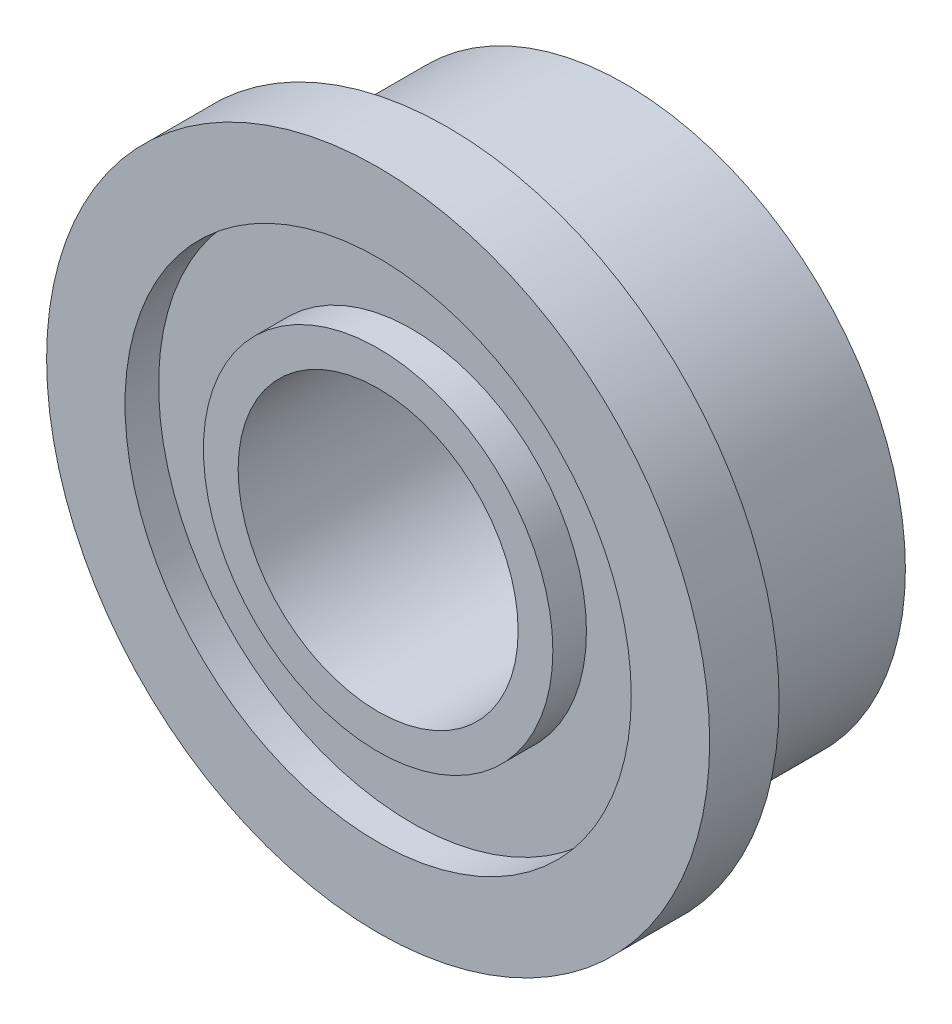
ISO-10303-21;
HEADER;
FILE_DESCRIPTION(('STEP AP214'),'2;1');
FILE_NAME('part.step','',(''),(''),'','','');
FILE_SCHEMA(('AUTOMOTIVE_DESIGN { 1 0 10303 214 1 1 1 1 }'));
ENDSEC;
DATA;
#1=APPLICATION_CONTEXT('core data for automotive mechanical design processes');
#2=APPLICATION_PROTOCOL_DEFINITION('international standard','automotive_design',2000,#1);
#3=PRODUCT_CONTEXT('',#1,'mechanical');
#4=PRODUCT('Part','Part','',(#3));
#5=PRODUCT_RELATED_PRODUCT_CATEGORY('part','',(#4));
#6=PRODUCT_DEFINITION_FORMATION('','',#4);
#7=PRODUCT_DEFINITION_CONTEXT('part definition',#1,'design');
#8=PRODUCT_DEFINITION('design','',#6,#7);
#9=PRODUCT_DEFINITION_SHAPE('','',#8);
#10=(LENGTH_UNIT() NAMED_UNIT(*) SI_UNIT(.MILLI.,.METRE.));
#11=(NAMED_UNIT(*) PLANE_ANGLE_UNIT() SI_UNIT($,.RADIAN.));
#12=(NAMED_UNIT(*) SI_UNIT($,.STERADIAN.) SOLID_ANGLE_UNIT());
#13=UNCERTAINTY_MEASURE_WITH_UNIT(LENGTH_MEASURE(1.E-05),#10,'distance_accuracy_value','');
#14=(GEOMETRIC_REPRESENTATION_CONTEXT(3) GLOBAL_UNCERTAINTY_ASSIGNED_CONTEXT((#13)) GLOBAL_UNIT_ASSIGNED_CONTEXT((#10,
#11,#12)) REPRESENTATION_CONTEXT('',''));
#15=CARTESIAN_POINT('',(0.,0.,0.));
#16=DIRECTION('',(0.,0.,1.));
#17=DIRECTION('',(1.,0.,0.));
#18=AXIS2_PLACEMENT_3D('',#15,#16,#17);
#19=CARTESIAN_POINT('',(0.,0.,2.803525));
#20=DIRECTION('',(0.,0.,1.));
#21=DIRECTION('',(1.,0.,0.));
#22=AXIS2_PLACEMENT_3D('',#19,#20,#21);
#23=PLANE('',#22);
#24=CARTESIAN_POINT('',(0.,0.,2.803525));
#25=DIRECTION('',(0.,0.,1.));
#26=DIRECTION('',(1.,0.,0.));
#27=AXIS2_PLACEMENT_3D('',#24,#25,#26);
#28=CIRCLE('',#27,1.5875);
#29=CARTESIAN_POINT('',(1.5875,0.,2.803525));
#30=VERTEX_POINT('',#29);
#31=EDGE_CURVE('E50',#30,#30,#28,.T.);
#32=ORIENTED_EDGE('',*,*,#31,.F.);
#33=EDGE_LOOP('',(#32));
#34=FACE_BOUND('',#33,.T.);
#35=CARTESIAN_POINT('',(0.,0.,2.803525));
#36=DIRECTION('',(0.,0.,1.));
#37=DIRECTION('',(1.,0.,0.));
#38=AXIS2_PLACEMENT_3D('',#35,#36,#37);
#39=CIRCLE('',#38,1.9812);
#40=CARTESIAN_POINT('',(1.9812,0.,2.803525));
#41=VERTEX_POINT('',#40);
#42=EDGE_CURVE('E62',#41,#41,#39,.T.);
#43=ORIENTED_EDGE('',*,*,#42,.T.);
#44=EDGE_LOOP('',(#43));
#45=FACE_BOUND('',#44,.T.);
#46=ADVANCED_FACE('F31',(#34,#45),#23,.T.);
#47=CARTESIAN_POINT('',(0.,0.,0.));
#48=DIRECTION('',(0.,0.,1.));
#49=DIRECTION('',(1.,0.,0.));
#50=AXIS2_PLACEMENT_3D('',#47,#48,#49);
#51=PLANE('',#50);
#52=CARTESIAN_POINT('',(0.,0.,0.));
#53=DIRECTION('',(0.,0.,1.));
#54=DIRECTION('',(1.,0.,0.));
#55=AXIS2_PLACEMENT_3D('',#52,#53,#54);
#56=CIRCLE('',#55,3.175);
#57=CARTESIAN_POINT('',(3.175,0.,0.));
#58=VERTEX_POINT('',#57);
#59=EDGE_CURVE('E35',#58,#58,#56,.T.);
#60=ORIENTED_EDGE('',*,*,#59,.F.);
#61=EDGE_LOOP('',(#60));
#62=FACE_BOUND('',#61,.T.);
#63=CARTESIAN_POINT('',(0.,0.,0.));
#64=DIRECTION('',(0.,0.,1.));
#65=DIRECTION('',(1.,0.,0.));
#66=AXIS2_PLACEMENT_3D('',#63,#64,#65);
#67=CIRCLE('',#66,1.5875);
#68=CARTESIAN_POINT('',(1.5875,0.,0.));
#69=VERTEX_POINT('',#68);
#70=EDGE_CURVE('E42',#69,#69,#67,.T.);
#71=ORIENTED_EDGE('',*,*,#70,.T.);
#72=EDGE_LOOP('',(#71));
#73=FACE_BOUND('',#72,.T.);
#74=ADVANCED_FACE('F105',(#62,#73),#51,.F.);
#75=CARTESIAN_POINT('',(0.,0.,2.016125));
#76=DIRECTION('',(0.,0.,-1.));
#77=DIRECTION('',(-1.,0.,0.));
#78=AXIS2_PLACEMENT_3D('',#75,#76,#77);
#79=CYLINDRICAL_SURFACE('',#78,3.175);
#80=CARTESIAN_POINT('',(0.,0.,2.016125));
#81=DIRECTION('',(0.,0.,1.));
#82=DIRECTION('',(1.,0.,0.));
#83=AXIS2_PLACEMENT_3D('',#80,#81,#82);
#84=CIRCLE('',#83,3.175);
#85=CARTESIAN_POINT('',(3.175,0.,2.016125));
#86=VERTEX_POINT('',#85);
#87=EDGE_CURVE('E10',#86,#86,#84,.T.);
#88=ORIENTED_EDGE('',*,*,#87,.F.);
#89=EDGE_LOOP('',(#88));
#90=FACE_BOUND('',#89,.T.);
#91=ORIENTED_EDGE('',*,*,#59,.T.);
#92=EDGE_LOOP('',(#91));
#93=FACE_BOUND('',#92,.T.);
#94=ADVANCED_FACE('F33',(#90,#93),#79,.T.);
#95=CARTESIAN_POINT('',(0.,0.,2.016125));
#96=DIRECTION('',(0.,0.,-1.));
#97=DIRECTION('',(-1.,0.,0.));
#98=AXIS2_PLACEMENT_3D('',#95,#96,#97);
#99=CYLINDRICAL_SURFACE('',#98,1.5875);
#100=ORIENTED_EDGE('',*,*,#70,.F.);
#101=EDGE_LOOP('',(#100));
#102=FACE_BOUND('',#101,.T.);
#103=ORIENTED_EDGE('',*,*,#31,.T.);
#104=EDGE_LOOP('',(#103));
#105=FACE_BOUND('',#104,.T.);
#106=ADVANCED_FACE('F97',(#102,#105),#99,.F.);
#107=CARTESIAN_POINT('',(0.,0.,2.016125));
#108=DIRECTION('',(0.,0.,1.));
#109=DIRECTION('',(1.,0.,0.));
#110=AXIS2_PLACEMENT_3D('',#107,#108,#109);
#111=PLANE('',#110);
#112=CARTESIAN_POINT('',(0.,0.,2.016125));
#113=DIRECTION('',(0.,0.,1.));
#114=DIRECTION('',(1.,0.,0.));
#115=AXIS2_PLACEMENT_3D('',#112,#113,#114);
#116=CIRCLE('',#115,3.7592);
#117=CARTESIAN_POINT('',(3.7592,0.,2.016125));
#118=VERTEX_POINT('',#117);
#119=EDGE_CURVE('E47',#118,#118,#116,.T.);
#120=ORIENTED_EDGE('',*,*,#119,.F.);
#121=EDGE_LOOP('',(#120));
#122=FACE_BOUND('',#121,.T.);
#123=ORIENTED_EDGE('',*,*,#87,.T.);
#124=EDGE_LOOP('',(#123));
#125=FACE_BOUND('',#124,.T.);
#126=ADVANCED_FACE('F87',(#122,#125),#111,.F.);
#127=CARTESIAN_POINT('',(0.,0.,2.803525));
#128=DIRECTION('',(0.,0.,1.));
#129=DIRECTION('',(1.,0.,0.));
#130=AXIS2_PLACEMENT_3D('',#127,#128,#129);
#131=CIRCLE('',#130,2.8702);
#132=CARTESIAN_POINT('',(2.8702,0.,2.803525));
#133=VERTEX_POINT('',#132);
#134=EDGE_CURVE('E56',#133,#133,#131,.T.);
#135=ORIENTED_EDGE('',*,*,#134,.F.);
#136=EDGE_LOOP('',(#135));
#137=FACE_BOUND('',#136,.T.);
#138=CARTESIAN_POINT('',(0.,0.,2.803525));
#139=DIRECTION('',(0.,0.,1.));
#140=DIRECTION('',(1.,0.,0.));
#141=AXIS2_PLACEMENT_3D('',#138,#139,#140);
#142=CIRCLE('',#141,3.7592);
#143=CARTESIAN_POINT('',(3.7592,0.,2.803525));
#144=VERTEX_POINT('',#143);
#145=EDGE_CURVE('E46',#144,#144,#142,.T.);
#146=ORIENTED_EDGE('',*,*,#145,.T.);
#147=EDGE_LOOP('',(#146));
#148=FACE_BOUND('',#147,.T.);
#149=ADVANCED_FACE('F84',(#137,#148),#23,.T.);
#150=CARTESIAN_POINT('',(0.,0.,2.803525));
#151=DIRECTION('',(0.,0.,-1.));
#152=DIRECTION('',(-1.,0.,0.));
#153=AXIS2_PLACEMENT_3D('',#150,#151,#152);
#154=CYLINDRICAL_SURFACE('',#153,3.7592);
#155=ORIENTED_EDGE('',*,*,#145,.F.);
#156=EDGE_LOOP('',(#155));
#157=FACE_BOUND('',#156,.T.);
#158=ORIENTED_EDGE('',*,*,#119,.T.);
#159=EDGE_LOOP('',(#158));
#160=FACE_BOUND('',#159,.T.);
#161=ADVANCED_FACE('F80',(#157,#160),#154,.T.);
#162=CARTESIAN_POINT('',(0.,0.,2.422525));
#163=DIRECTION('',(0.,0.,1.));
#164=DIRECTION('',(1.,0.,0.));
#165=AXIS2_PLACEMENT_3D('',#162,#163,#164);
#166=CYLINDRICAL_SURFACE('',#165,2.8702);
#167=CARTESIAN_POINT('',(0.,0.,2.422525));
#168=DIRECTION('',(0.,0.,1.));
#169=DIRECTION('',(1.,0.,0.));
#170=AXIS2_PLACEMENT_3D('',#167,#168,#169);
#171=CIRCLE('',#170,2.8702);
#172=CARTESIAN_POINT('',(2.8702,0.,2.422525));
#173=VERTEX_POINT('',#172);
#174=EDGE_CURVE('E55',#173,#173,#171,.T.);
#175=ORIENTED_EDGE('',*,*,#174,.F.);
#176=EDGE_LOOP('',(#175));
#177=FACE_BOUND('',#176,.T.);
#178=ORIENTED_EDGE('',*,*,#134,.T.);
#179=EDGE_LOOP('',(#178));
#180=FACE_BOUND('',#179,.T.);
#181=ADVANCED_FACE('F74',(#177,#180),#166,.F.);
#182=CARTESIAN_POINT('',(0.,0.,2.422525));
#183=DIRECTION('',(0.,0.,1.));
#184=DIRECTION('',(1.,0.,0.));
#185=AXIS2_PLACEMENT_3D('',#182,#183,#184);
#186=PLANE('',#185);
#187=CARTESIAN_POINT('',(0.,0.,2.422525));
#188=DIRECTION('',(0.,0.,1.));
#189=DIRECTION('',(1.,0.,0.));
#190=AXIS2_PLACEMENT_3D('',#187,#188,#189);
#191=CIRCLE('',#190,1.9812);
#192=CARTESIAN_POINT('',(1.9812,0.,2.422525));
#193=VERTEX_POINT('',#192);
#194=EDGE_CURVE('E59',#193,#193,#191,.T.);
#195=ORIENTED_EDGE('',*,*,#194,.F.);
#196=EDGE_LOOP('',(#195));
#197=FACE_BOUND('',#196,.T.);
#198=ORIENTED_EDGE('',*,*,#174,.T.);
#199=EDGE_LOOP('',(#198));
#200=FACE_BOUND('',#199,.T.);
#201=ADVANCED_FACE('F71',(#197,#200),#186,.T.);
#202=CARTESIAN_POINT('',(0.,0.,2.422525));
#203=DIRECTION('',(0.,0.,1.));
#204=DIRECTION('',(1.,0.,0.));
#205=AXIS2_PLACEMENT_3D('',#202,#203,#204);
#206=CYLINDRICAL_SURFACE('',#205,1.9812);
#207=ORIENTED_EDGE('',*,*,#194,.T.);
#208=EDGE_LOOP('',(#207));
#209=FACE_BOUND('',#208,.T.);
#210=ORIENTED_EDGE('',*,*,#42,.F.);
#211=EDGE_LOOP('',(#210));
#212=FACE_BOUND('',#211,.T.);
#213=ADVANCED_FACE('F68',(#209,#212),#206,.T.);
#214=CLOSED_SHELL('',(#46,#74,#94,#106,#126,#149,#161,#181,#201,#213));
#215=MANIFOLD_SOLID_BREP('B2',#214);
#216=ADVANCED_BREP_SHAPE_REPRESENTATION('',(#18,#215),#14);
#217=SHAPE_DEFINITION_REPRESENTATION(#9,#216);
ENDSEC;
END-ISO-10303-21;
